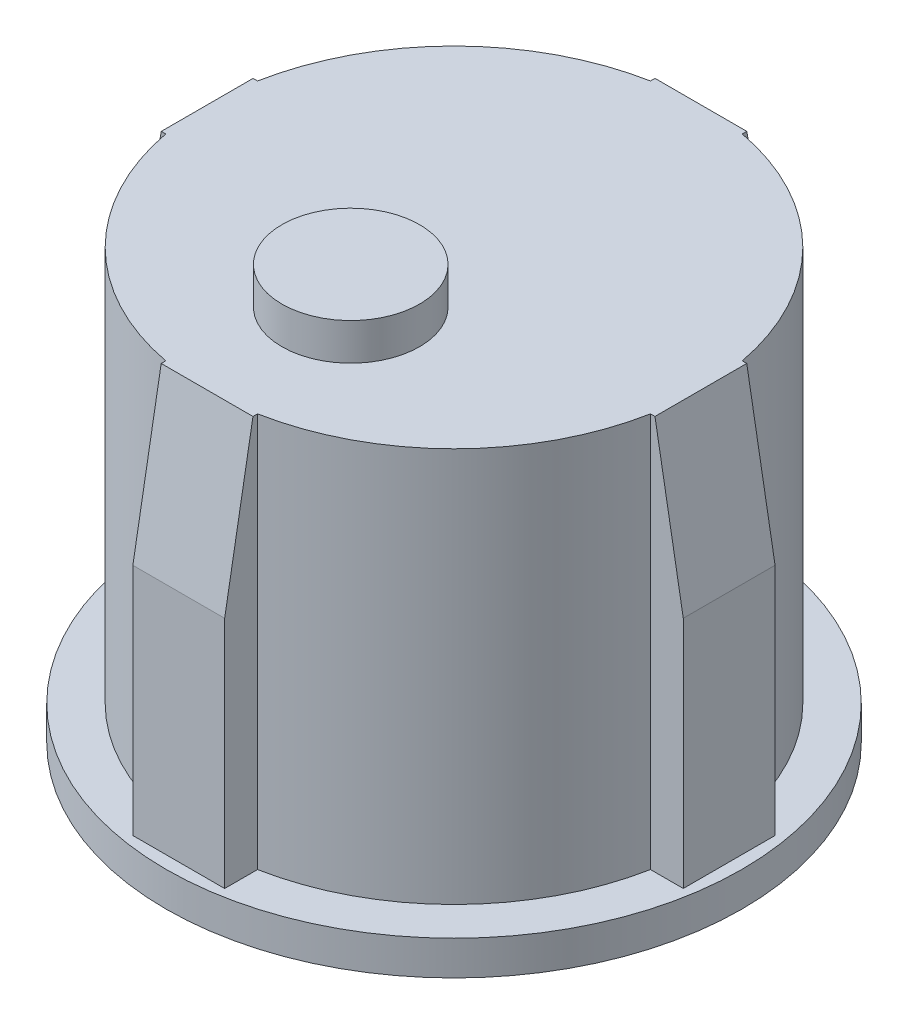
ISO-10303-21;
HEADER;
FILE_DESCRIPTION(('STEP AP214'),'2;1');
FILE_NAME('part.step','',(''),(''),'','','');
FILE_SCHEMA(('AUTOMOTIVE_DESIGN { 1 0 10303 214 1 1 1 1 }'));
ENDSEC;
DATA;
#1=APPLICATION_CONTEXT('core data for automotive mechanical design processes');
#2=APPLICATION_PROTOCOL_DEFINITION('international standard','automotive_design',2000,#1);
#3=PRODUCT_CONTEXT('',#1,'mechanical');
#4=PRODUCT('Part','Part','',(#3));
#5=PRODUCT_RELATED_PRODUCT_CATEGORY('part','',(#4));
#6=PRODUCT_DEFINITION_FORMATION('','',#4);
#7=PRODUCT_DEFINITION_CONTEXT('part definition',#1,'design');
#8=PRODUCT_DEFINITION('design','',#6,#7);
#9=PRODUCT_DEFINITION_SHAPE('','',#8);
#10=(LENGTH_UNIT() NAMED_UNIT(*) SI_UNIT(.MILLI.,.METRE.));
#11=(NAMED_UNIT(*) PLANE_ANGLE_UNIT() SI_UNIT($,.RADIAN.));
#12=(NAMED_UNIT(*) SI_UNIT($,.STERADIAN.) SOLID_ANGLE_UNIT());
#13=UNCERTAINTY_MEASURE_WITH_UNIT(LENGTH_MEASURE(1.E-05),#10,'distance_accuracy_value','');
#14=(GEOMETRIC_REPRESENTATION_CONTEXT(3) GLOBAL_UNCERTAINTY_ASSIGNED_CONTEXT((#13)) GLOBAL_UNIT_ASSIGNED_CONTEXT((#10,
#11,#12)) REPRESENTATION_CONTEXT('',''));
#15=CARTESIAN_POINT('',(0.,0.,0.));
#16=DIRECTION('',(0.,0.,1.));
#17=DIRECTION('',(1.,0.,0.));
#18=AXIS2_PLACEMENT_3D('',#15,#16,#17);
#19=CARTESIAN_POINT('',(0.,1.5,0.));
#20=DIRECTION('',(0.,1.,0.));
#21=DIRECTION('',(0.,0.,1.));
#22=AXIS2_PLACEMENT_3D('',#19,#20,#21);
#23=PLANE('',#22);
#24=CARTESIAN_POINT('',(0.,1.5,0.));
#25=DIRECTION('',(0.,1.,0.));
#26=DIRECTION('',(0.,0.,1.));
#27=AXIS2_PLACEMENT_3D('',#24,#25,#26);
#28=CIRCLE('',#27,12.55);
#29=CARTESIAN_POINT('',(0.,1.5,12.55));
#30=VERTEX_POINT('',#29);
#31=EDGE_CURVE('E341',#30,#30,#28,.T.);
#32=ORIENTED_EDGE('',*,*,#31,.T.);
#33=EDGE_LOOP('',(#32));
#34=FACE_BOUND('',#33,.T.);
#35=CARTESIAN_POINT('',(0.,1.5,0.));
#36=DIRECTION('',(0.,1.,0.));
#37=DIRECTION('',(0.,0.,1.));
#38=AXIS2_PLACEMENT_3D('',#35,#36,#37);
#39=CIRCLE('',#38,10.75);
#40=CARTESIAN_POINT('',(1.99999999999999,1.5,10.5623150871388));
#41=VERTEX_POINT('',#40);
#42=CARTESIAN_POINT('',(10.5623150871388,1.5,1.99999999999999));
#43=VERTEX_POINT('',#42);
#44=EDGE_CURVE('E208',#41,#43,#39,.T.);
#45=ORIENTED_EDGE('',*,*,#44,.F.);
#46=DIRECTION('',(0.,0.,-1.));
#47=VECTOR('',#46,1.);
#48=CARTESIAN_POINT('',(1.99999999999999,1.5,11.994879817949));
#49=LINE('',#48,#47);
#50=CARTESIAN_POINT('',(1.99999999999999,1.5,11.994879817949));
#51=VERTEX_POINT('',#50);
#52=EDGE_CURVE('E291',#51,#41,#49,.T.);
#53=ORIENTED_EDGE('',*,*,#52,.F.);
#54=DIRECTION('',(1.,0.,0.));
#55=VECTOR('',#54,1.);
#56=CARTESIAN_POINT('',(1.99999999999999,1.5,11.994879817949));
#57=LINE('',#56,#55);
#58=CARTESIAN_POINT('',(-2.00000000000001,1.5,11.994879817949));
#59=VERTEX_POINT('',#58);
#60=EDGE_CURVE('E293',#59,#51,#57,.T.);
#61=ORIENTED_EDGE('',*,*,#60,.F.);
#62=DIRECTION('',(0.,0.,1.));
#63=VECTOR('',#62,1.);
#64=CARTESIAN_POINT('',(-2.00000000000001,1.5,11.994879817949));
#65=LINE('',#64,#63);
#66=CARTESIAN_POINT('',(-2.00000000000001,1.5,10.5623150871388));
#67=VERTEX_POINT('',#66);
#68=EDGE_CURVE('E289',#67,#59,#65,.T.);
#69=ORIENTED_EDGE('',*,*,#68,.F.);
#70=CARTESIAN_POINT('',(-10.5623150871388,1.5,2.));
#71=VERTEX_POINT('',#70);
#72=EDGE_CURVE('E187',#71,#67,#39,.T.);
#73=ORIENTED_EDGE('',*,*,#72,.F.);
#74=DIRECTION('',(1.,0.,0.));
#75=VECTOR('',#74,1.);
#76=CARTESIAN_POINT('',(-11.9923150871388,1.5,2.));
#77=LINE('',#76,#75);
#78=CARTESIAN_POINT('',(-11.9923150871388,1.5,2.));
#79=VERTEX_POINT('',#78);
#80=EDGE_CURVE('E272',#79,#71,#77,.T.);
#81=ORIENTED_EDGE('',*,*,#80,.F.);
#82=DIRECTION('',(0.,0.,1.));
#83=VECTOR('',#82,1.);
#84=CARTESIAN_POINT('',(-11.9923150871388,1.5,2.));
#85=LINE('',#84,#83);
#86=CARTESIAN_POINT('',(-11.9923150871388,1.5,-2.));
#87=VERTEX_POINT('',#86);
#88=EDGE_CURVE('E275',#87,#79,#85,.T.);
#89=ORIENTED_EDGE('',*,*,#88,.F.);
#90=DIRECTION('',(-1.,0.,0.));
#91=VECTOR('',#90,1.);
#92=CARTESIAN_POINT('',(-11.9923150871388,1.5,-2.));
#93=LINE('',#92,#91);
#94=CARTESIAN_POINT('',(-10.5623150871388,1.5,-2.));
#95=VERTEX_POINT('',#94);
#96=EDGE_CURVE('E278',#95,#87,#93,.T.);
#97=ORIENTED_EDGE('',*,*,#96,.F.);
#98=CARTESIAN_POINT('',(-2.,1.5,-10.5623150871388));
#99=VERTEX_POINT('',#98);
#100=EDGE_CURVE('E204',#99,#95,#39,.T.);
#101=ORIENTED_EDGE('',*,*,#100,.F.);
#102=DIRECTION('',(0.,0.,1.));
#103=VECTOR('',#102,1.);
#104=CARTESIAN_POINT('',(-2.,1.5,-11.994879817949));
#105=LINE('',#104,#103);
#106=CARTESIAN_POINT('',(-2.,1.5,-11.994879817949));
#107=VERTEX_POINT('',#106);
#108=EDGE_CURVE('E232',#107,#99,#105,.T.);
#109=ORIENTED_EDGE('',*,*,#108,.F.);
#110=DIRECTION('',(-1.,0.,0.));
#111=VECTOR('',#110,1.);
#112=CARTESIAN_POINT('',(2.,1.5,-11.994879817949));
#113=LINE('',#112,#111);
#114=CARTESIAN_POINT('',(2.,1.5,-11.994879817949));
#115=VERTEX_POINT('',#114);
#116=EDGE_CURVE('E235',#115,#107,#113,.T.);
#117=ORIENTED_EDGE('',*,*,#116,.F.);
#118=DIRECTION('',(0.,0.,-1.));
#119=VECTOR('',#118,1.);
#120=CARTESIAN_POINT('',(2.,1.5,-11.994879817949));
#121=LINE('',#120,#119);
#122=CARTESIAN_POINT('',(2.,1.5,-10.5623150871388));
#123=VERTEX_POINT('',#122);
#124=EDGE_CURVE('E238',#123,#115,#121,.T.);
#125=ORIENTED_EDGE('',*,*,#124,.F.);
#126=CARTESIAN_POINT('',(10.5623150871388,1.5,-2.00000000000001));
#127=VERTEX_POINT('',#126);
#128=EDGE_CURVE('E209',#127,#123,#39,.T.);
#129=ORIENTED_EDGE('',*,*,#128,.F.);
#130=DIRECTION('',(-1.,0.,0.));
#131=VECTOR('',#130,1.);
#132=CARTESIAN_POINT('',(11.9923150871388,1.5,-2.00000000000001));
#133=LINE('',#132,#131);
#134=CARTESIAN_POINT('',(11.9923150871388,1.5,-2.00000000000001));
#135=VERTEX_POINT('',#134);
#136=EDGE_CURVE('E256',#135,#127,#133,.T.);
#137=ORIENTED_EDGE('',*,*,#136,.F.);
#138=DIRECTION('',(0.,0.,-1.));
#139=VECTOR('',#138,1.);
#140=CARTESIAN_POINT('',(11.9923150871388,1.5,1.99999999999999));
#141=LINE('',#140,#139);
#142=CARTESIAN_POINT('',(11.9923150871388,1.5,1.99999999999999));
#143=VERTEX_POINT('',#142);
#144=EDGE_CURVE('E258',#143,#135,#141,.T.);
#145=ORIENTED_EDGE('',*,*,#144,.F.);
#146=DIRECTION('',(1.,0.,0.));
#147=VECTOR('',#146,1.);
#148=CARTESIAN_POINT('',(11.9923150871388,1.5,1.99999999999999));
#149=LINE('',#148,#147);
#150=EDGE_CURVE('E252',#43,#143,#149,.T.);
#151=ORIENTED_EDGE('',*,*,#150,.F.);
#152=EDGE_LOOP('',(#45,#53,#61,#69,#73,#81,#89,#97,#101,#109,#117,#125,#129,#137,#145,#151));
#153=FACE_BOUND('',#152,.T.);
#154=ADVANCED_FACE('F32',(#34,#153),#23,.T.);
#155=CARTESIAN_POINT('',(0.,18.7,0.));
#156=DIRECTION('',(0.,-1.,0.));
#157=DIRECTION('',(0.,0.,-1.));
#158=AXIS2_PLACEMENT_3D('',#155,#156,#157);
#159=CYLINDRICAL_SURFACE('',#158,10.75);
#160=DIRECTION('',(0.,-1.,0.));
#161=VECTOR('',#160,1.);
#162=CARTESIAN_POINT('',(1.99999999999999,18.7,10.5623150871388));
#163=LINE('',#162,#161);
#164=CARTESIAN_POINT('',(1.99999999999999,18.7,10.5623150871388));
#165=VERTEX_POINT('',#164);
#166=EDGE_CURVE('E188',#165,#41,#163,.T.);
#167=ORIENTED_EDGE('',*,*,#166,.T.);
#168=ORIENTED_EDGE('',*,*,#44,.T.);
#169=DIRECTION('',(0.,-1.,0.));
#170=VECTOR('',#169,1.);
#171=CARTESIAN_POINT('',(10.5623150871388,18.7,1.99999999999999));
#172=LINE('',#171,#170);
#173=CARTESIAN_POINT('',(10.5623150871388,18.7,1.99999999999999));
#174=VERTEX_POINT('',#173);
#175=EDGE_CURVE('E246',#174,#43,#172,.T.);
#176=ORIENTED_EDGE('',*,*,#175,.F.);
#177=CARTESIAN_POINT('',(0.,18.7,0.));
#178=DIRECTION('',(0.,1.,0.));
#179=DIRECTION('',(0.,0.,1.));
#180=AXIS2_PLACEMENT_3D('',#177,#178,#179);
#181=CIRCLE('',#180,10.75);
#182=EDGE_CURVE('E197',#165,#174,#181,.T.);
#183=ORIENTED_EDGE('',*,*,#182,.F.);
#184=EDGE_LOOP('',(#167,#168,#176,#183));
#185=FACE_BOUND('',#184,.T.);
#186=ADVANCED_FACE('F400',(#185),#159,.T.);
#187=DIRECTION('',(0.,-1.,0.));
#188=VECTOR('',#187,1.);
#189=CARTESIAN_POINT('',(-2.00000000000001,18.7,10.5623150871388));
#190=LINE('',#189,#188);
#191=CARTESIAN_POINT('',(-2.00000000000001,18.7,10.5623150871388));
#192=VERTEX_POINT('',#191);
#193=EDGE_CURVE('E170',#192,#67,#190,.T.);
#194=ORIENTED_EDGE('',*,*,#193,.F.);
#195=CARTESIAN_POINT('',(-10.5623150871388,18.7,2.));
#196=VERTEX_POINT('',#195);
#197=EDGE_CURVE('E185',#196,#192,#181,.T.);
#198=ORIENTED_EDGE('',*,*,#197,.F.);
#199=DIRECTION('',(0.,-1.,0.));
#200=VECTOR('',#199,1.);
#201=CARTESIAN_POINT('',(-10.5623150871388,18.7,2.));
#202=LINE('',#201,#200);
#203=EDGE_CURVE('E268',#196,#71,#202,.T.);
#204=ORIENTED_EDGE('',*,*,#203,.T.);
#205=ORIENTED_EDGE('',*,*,#72,.T.);
#206=EDGE_LOOP('',(#194,#198,#204,#205));
#207=FACE_BOUND('',#206,.T.);
#208=ADVANCED_FACE('F183',(#207),#159,.T.);
#209=DIRECTION('',(0.,-1.,0.));
#210=VECTOR('',#209,1.);
#211=CARTESIAN_POINT('',(-10.5623150871388,18.7,-2.));
#212=LINE('',#211,#210);
#213=CARTESIAN_POINT('',(-10.5623150871388,18.7,-2.));
#214=VERTEX_POINT('',#213);
#215=EDGE_CURVE('E270',#214,#95,#212,.T.);
#216=ORIENTED_EDGE('',*,*,#215,.F.);
#217=CARTESIAN_POINT('',(-2.,18.7,-10.5623150871388));
#218=VERTEX_POINT('',#217);
#219=EDGE_CURVE('E196',#218,#214,#181,.T.);
#220=ORIENTED_EDGE('',*,*,#219,.F.);
#221=DIRECTION('',(0.,-1.,0.));
#222=VECTOR('',#221,1.);
#223=CARTESIAN_POINT('',(-2.,18.7,-10.5623150871388));
#224=LINE('',#223,#222);
#225=EDGE_CURVE('E229',#218,#99,#224,.T.);
#226=ORIENTED_EDGE('',*,*,#225,.T.);
#227=ORIENTED_EDGE('',*,*,#100,.T.);
#228=EDGE_LOOP('',(#216,#220,#226,#227));
#229=FACE_BOUND('',#228,.T.);
#230=ADVANCED_FACE('F398',(#229),#159,.T.);
#231=DIRECTION('',(0.,-1.,0.));
#232=VECTOR('',#231,1.);
#233=CARTESIAN_POINT('',(10.5623150871388,18.7,-2.00000000000001));
#234=LINE('',#233,#232);
#235=CARTESIAN_POINT('',(10.5623150871388,18.7,-2.00000000000001));
#236=VERTEX_POINT('',#235);
#237=EDGE_CURVE('E244',#236,#127,#234,.T.);
#238=ORIENTED_EDGE('',*,*,#237,.T.);
#239=ORIENTED_EDGE('',*,*,#128,.T.);
#240=DIRECTION('',(0.,-1.,0.));
#241=VECTOR('',#240,1.);
#242=CARTESIAN_POINT('',(2.,18.7,-10.5623150871388));
#243=LINE('',#242,#241);
#244=CARTESIAN_POINT('',(2.,18.7,-10.5623150871388));
#245=VERTEX_POINT('',#244);
#246=EDGE_CURVE('E215',#245,#123,#243,.T.);
#247=ORIENTED_EDGE('',*,*,#246,.F.);
#248=EDGE_CURVE('E199',#236,#245,#181,.T.);
#249=ORIENTED_EDGE('',*,*,#248,.F.);
#250=EDGE_LOOP('',(#238,#239,#247,#249));
#251=FACE_BOUND('',#250,.T.);
#252=ADVANCED_FACE('F396',(#251),#159,.T.);
#253=CARTESIAN_POINT('',(0.,1.5,0.));
#254=DIRECTION('',(0.,-1.,0.));
#255=DIRECTION('',(0.,0.,-1.));
#256=AXIS2_PLACEMENT_3D('',#253,#254,#255);
#257=CYLINDRICAL_SURFACE('',#256,12.55);
#258=ORIENTED_EDGE('',*,*,#31,.F.);
#259=EDGE_LOOP('',(#258));
#260=FACE_BOUND('',#259,.T.);
#261=CARTESIAN_POINT('',(0.,0.,0.));
#262=DIRECTION('',(0.,1.,0.));
#263=DIRECTION('',(0.,0.,1.));
#264=AXIS2_PLACEMENT_3D('',#261,#262,#263);
#265=CIRCLE('',#264,12.55);
#266=CARTESIAN_POINT('',(0.,0.,12.55));
#267=VERTEX_POINT('',#266);
#268=EDGE_CURVE('E201',#267,#267,#265,.T.);
#269=ORIENTED_EDGE('',*,*,#268,.T.);
#270=EDGE_LOOP('',(#269));
#271=FACE_BOUND('',#270,.T.);
#272=ADVANCED_FACE('F335',(#260,#271),#257,.T.);
#273=CARTESIAN_POINT('',(0.,0.,0.));
#274=DIRECTION('',(0.,1.,0.));
#275=DIRECTION('',(0.,0.,1.));
#276=AXIS2_PLACEMENT_3D('',#273,#274,#275);
#277=PLANE('',#276);
#278=CARTESIAN_POINT('',(0.,0.,0.));
#279=DIRECTION('',(0.,-1.,0.));
#280=DIRECTION('',(0.,0.,-1.));
#281=AXIS2_PLACEMENT_3D('',#278,#279,#280);
#282=CIRCLE('',#281,7.);
#283=CARTESIAN_POINT('',(0.,0.,-7.));
#284=VERTEX_POINT('',#283);
#285=EDGE_CURVE('E304',#284,#284,#282,.T.);
#286=ORIENTED_EDGE('',*,*,#285,.F.);
#287=EDGE_LOOP('',(#286));
#288=FACE_BOUND('',#287,.T.);
#289=ORIENTED_EDGE('',*,*,#268,.F.);
#290=EDGE_LOOP('',(#289));
#291=FACE_BOUND('',#290,.T.);
#292=ADVANCED_FACE('F332',(#288,#291),#277,.F.);
#293=CARTESIAN_POINT('',(0.,18.7,0.));
#294=DIRECTION('',(0.,1.,0.));
#295=DIRECTION('',(0.,0.,1.));
#296=AXIS2_PLACEMENT_3D('',#293,#294,#295);
#297=PLANE('',#296);
#298=CARTESIAN_POINT('',(0.,18.7,4.5));
#299=DIRECTION('',(0.,1.,0.));
#300=DIRECTION('',(0.,0.,1.));
#301=AXIS2_PLACEMENT_3D('',#298,#299,#300);
#302=CIRCLE('',#301,3.);
#303=CARTESIAN_POINT('',(0.,18.7,7.5));
#304=VERTEX_POINT('',#303);
#305=EDGE_CURVE('E298',#304,#304,#302,.T.);
#306=ORIENTED_EDGE('',*,*,#305,.F.);
#307=EDGE_LOOP('',(#306));
#308=FACE_BOUND('',#307,.T.);
#309=DIRECTION('',(0.,0.,-1.));
#310=VECTOR('',#309,1.);
#311=CARTESIAN_POINT('',(2.,18.7,-11.994879817949));
#312=LINE('',#311,#310);
#313=CARTESIAN_POINT('',(2.,18.7,-10.7605909529898));
#314=VERTEX_POINT('',#313);
#315=EDGE_CURVE('E234',#245,#314,#312,.T.);
#316=ORIENTED_EDGE('',*,*,#315,.T.);
#317=DIRECTION('',(-1.,0.,0.));
#318=VECTOR('',#317,1.);
#319=CARTESIAN_POINT('',(-2.,18.7,-10.7605909529898));
#320=LINE('',#319,#318);
#321=CARTESIAN_POINT('',(-2.,18.7,-10.7605909529898));
#322=VERTEX_POINT('',#321);
#323=EDGE_CURVE('E352',#314,#322,#320,.T.);
#324=ORIENTED_EDGE('',*,*,#323,.T.);
#325=DIRECTION('',(0.,0.,1.));
#326=VECTOR('',#325,1.);
#327=CARTESIAN_POINT('',(-2.,18.7,-11.994879817949));
#328=LINE('',#327,#326);
#329=EDGE_CURVE('E231',#322,#218,#328,.T.);
#330=ORIENTED_EDGE('',*,*,#329,.T.);
#331=ORIENTED_EDGE('',*,*,#219,.T.);
#332=DIRECTION('',(-1.,0.,0.));
#333=VECTOR('',#332,1.);
#334=CARTESIAN_POINT('',(-11.9923150871388,18.7,-2.));
#335=LINE('',#334,#333);
#336=CARTESIAN_POINT('',(-10.7580262221795,18.7,-2.));
#337=VERTEX_POINT('',#336);
#338=EDGE_CURVE('E274',#214,#337,#335,.T.);
#339=ORIENTED_EDGE('',*,*,#338,.T.);
#340=DIRECTION('',(0.,0.,1.));
#341=VECTOR('',#340,1.);
#342=CARTESIAN_POINT('',(-10.7580262221795,18.7,2.));
#343=LINE('',#342,#341);
#344=CARTESIAN_POINT('',(-10.7580262221795,18.7,2.));
#345=VERTEX_POINT('',#344);
#346=EDGE_CURVE('E350',#337,#345,#343,.T.);
#347=ORIENTED_EDGE('',*,*,#346,.T.);
#348=DIRECTION('',(1.,0.,0.));
#349=VECTOR('',#348,1.);
#350=CARTESIAN_POINT('',(-11.9923150871388,18.7,2.));
#351=LINE('',#350,#349);
#352=EDGE_CURVE('E194',#345,#196,#351,.T.);
#353=ORIENTED_EDGE('',*,*,#352,.T.);
#354=ORIENTED_EDGE('',*,*,#197,.T.);
#355=DIRECTION('',(0.,0.,1.));
#356=VECTOR('',#355,1.);
#357=CARTESIAN_POINT('',(-2.00000000000001,18.7,11.994879817949));
#358=LINE('',#357,#356);
#359=CARTESIAN_POINT('',(-2.00000000000001,18.7,10.7605909529898));
#360=VERTEX_POINT('',#359);
#361=EDGE_CURVE('E166',#192,#360,#358,.T.);
#362=ORIENTED_EDGE('',*,*,#361,.T.);
#363=DIRECTION('',(1.,0.,0.));
#364=VECTOR('',#363,1.);
#365=CARTESIAN_POINT('',(1.99999999999999,18.7,10.7605909529898));
#366=LINE('',#365,#364);
#367=CARTESIAN_POINT('',(1.99999999999999,18.7,10.7605909529898));
#368=VERTEX_POINT('',#367);
#369=EDGE_CURVE('E344',#360,#368,#366,.T.);
#370=ORIENTED_EDGE('',*,*,#369,.T.);
#371=DIRECTION('',(0.,0.,-1.));
#372=VECTOR('',#371,1.);
#373=CARTESIAN_POINT('',(1.99999999999999,18.7,11.994879817949));
#374=LINE('',#373,#372);
#375=EDGE_CURVE('E178',#368,#165,#374,.T.);
#376=ORIENTED_EDGE('',*,*,#375,.T.);
#377=ORIENTED_EDGE('',*,*,#182,.T.);
#378=DIRECTION('',(1.,0.,0.));
#379=VECTOR('',#378,1.);
#380=CARTESIAN_POINT('',(11.9923150871388,18.7,1.99999999999999));
#381=LINE('',#380,#379);
#382=CARTESIAN_POINT('',(10.7580262221795,18.7,1.99999999999999));
#383=VERTEX_POINT('',#382);
#384=EDGE_CURVE('E251',#174,#383,#381,.T.);
#385=ORIENTED_EDGE('',*,*,#384,.T.);
#386=DIRECTION('',(0.,0.,-1.));
#387=VECTOR('',#386,1.);
#388=CARTESIAN_POINT('',(10.7580262221795,18.7,-2.00000000000001));
#389=LINE('',#388,#387);
#390=CARTESIAN_POINT('',(10.7580262221795,18.7,-2.00000000000001));
#391=VERTEX_POINT('',#390);
#392=EDGE_CURVE('E347',#383,#391,#389,.T.);
#393=ORIENTED_EDGE('',*,*,#392,.T.);
#394=DIRECTION('',(-1.,0.,0.));
#395=VECTOR('',#394,1.);
#396=CARTESIAN_POINT('',(11.9923150871388,18.7,-2.00000000000001));
#397=LINE('',#396,#395);
#398=EDGE_CURVE('E255',#391,#236,#397,.T.);
#399=ORIENTED_EDGE('',*,*,#398,.T.);
#400=ORIENTED_EDGE('',*,*,#248,.T.);
#401=EDGE_LOOP('',(#316,#324,#330,#331,#339,#347,#353,#354,#362,#370,#376,#377,#385,#393,#399,#400));
#402=FACE_BOUND('',#401,.T.);
#403=ADVANCED_FACE('F191',(#308,#402),#297,.T.);
#404=CARTESIAN_POINT('',(2.,18.7,-11.994879817949));
#405=DIRECTION('',(-1.,0.,0.));
#406=DIRECTION('',(0.,0.,1.));
#407=AXIS2_PLACEMENT_3D('',#404,#405,#406);
#408=PLANE('',#407);
#409=DIRECTION('',(0.,-1.,0.));
#410=VECTOR('',#409,1.);
#411=CARTESIAN_POINT('',(2.,18.7,-11.994879817949));
#412=LINE('',#411,#410);
#413=CARTESIAN_POINT('',(2.,11.6999999999999,-11.994879817949));
#414=VERTEX_POINT('',#413);
#415=EDGE_CURVE('E221',#414,#115,#412,.T.);
#416=ORIENTED_EDGE('',*,*,#415,.F.);
#417=DIRECTION('',(0.,0.984807753012209,0.173648177666927));
#418=VECTOR('',#417,1.);
#419=CARTESIAN_POINT('',(2.,18.7,-10.7605909529898));
#420=LINE('',#419,#418);
#421=EDGE_CURVE('E359',#414,#314,#420,.T.);
#422=ORIENTED_EDGE('',*,*,#421,.T.);
#423=ORIENTED_EDGE('',*,*,#315,.F.);
#424=ORIENTED_EDGE('',*,*,#246,.T.);
#425=ORIENTED_EDGE('',*,*,#124,.T.);
#426=EDGE_LOOP('',(#416,#422,#423,#424,#425));
#427=FACE_BOUND('',#426,.T.);
#428=ADVANCED_FACE('F470',(#427),#408,.F.);
#429=CARTESIAN_POINT('',(2.,18.7,-11.994879817949));
#430=DIRECTION('',(0.,0.,1.));
#431=DIRECTION('',(1.,0.,0.));
#432=AXIS2_PLACEMENT_3D('',#429,#430,#431);
#433=PLANE('',#432);
#434=DIRECTION('',(0.,-1.,0.));
#435=VECTOR('',#434,1.);
#436=CARTESIAN_POINT('',(-2.,18.7,-11.994879817949));
#437=LINE('',#436,#435);
#438=CARTESIAN_POINT('',(-2.,11.6999999999999,-11.994879817949));
#439=VERTEX_POINT('',#438);
#440=EDGE_CURVE('E225',#439,#107,#437,.T.);
#441=ORIENTED_EDGE('',*,*,#440,.F.);
#442=DIRECTION('',(1.,0.,0.));
#443=VECTOR('',#442,1.);
#444=CARTESIAN_POINT('',(2.,11.6999999999999,-11.994879817949));
#445=LINE('',#444,#443);
#446=EDGE_CURVE('E357',#439,#414,#445,.T.);
#447=ORIENTED_EDGE('',*,*,#446,.T.);
#448=ORIENTED_EDGE('',*,*,#415,.T.);
#449=ORIENTED_EDGE('',*,*,#116,.T.);
#450=EDGE_LOOP('',(#441,#447,#448,#449));
#451=FACE_BOUND('',#450,.T.);
#452=ADVANCED_FACE('F466',(#451),#433,.F.);
#453=CARTESIAN_POINT('',(-2.,18.7,-11.994879817949));
#454=DIRECTION('',(1.,0.,0.));
#455=DIRECTION('',(0.,0.,-1.));
#456=AXIS2_PLACEMENT_3D('',#453,#454,#455);
#457=PLANE('',#456);
#458=ORIENTED_EDGE('',*,*,#329,.F.);
#459=DIRECTION('',(0.,-0.984807753012209,-0.173648177666927));
#460=VECTOR('',#459,1.);
#461=CARTESIAN_POINT('',(-2.,18.7,-10.7605909529898));
#462=LINE('',#461,#460);
#463=EDGE_CURVE('E355',#322,#439,#462,.T.);
#464=ORIENTED_EDGE('',*,*,#463,.T.);
#465=ORIENTED_EDGE('',*,*,#440,.T.);
#466=ORIENTED_EDGE('',*,*,#108,.T.);
#467=ORIENTED_EDGE('',*,*,#225,.F.);
#468=EDGE_LOOP('',(#458,#464,#465,#466,#467));
#469=FACE_BOUND('',#468,.T.);
#470=ADVANCED_FACE('F463',(#469),#457,.F.);
#471=CARTESIAN_POINT('',(11.9923150871388,18.7,1.99999999999999));
#472=DIRECTION('',(-1.,0.,0.));
#473=DIRECTION('',(0.,0.,1.));
#474=AXIS2_PLACEMENT_3D('',#471,#472,#473);
#475=PLANE('',#474);
#476=DIRECTION('',(0.,-1.,0.));
#477=VECTOR('',#476,1.);
#478=CARTESIAN_POINT('',(11.9923150871388,18.7,-2.00000000000001));
#479=LINE('',#478,#477);
#480=CARTESIAN_POINT('',(11.9923150871388,11.6999999999999,-2.00000000000001));
#481=VERTEX_POINT('',#480);
#482=EDGE_CURVE('E240',#481,#135,#479,.T.);
#483=ORIENTED_EDGE('',*,*,#482,.F.);
#484=DIRECTION('',(0.,0.,1.));
#485=VECTOR('',#484,1.);
#486=CARTESIAN_POINT('',(11.9923150871388,11.6999999999999,1.99999999999999));
#487=LINE('',#486,#485);
#488=CARTESIAN_POINT('',(11.9923150871388,11.6999999999999,1.99999999999999));
#489=VERTEX_POINT('',#488);
#490=EDGE_CURVE('E369',#481,#489,#487,.T.);
#491=ORIENTED_EDGE('',*,*,#490,.T.);
#492=DIRECTION('',(0.,-1.,0.));
#493=VECTOR('',#492,1.);
#494=CARTESIAN_POINT('',(11.9923150871388,18.7,1.99999999999999));
#495=LINE('',#494,#493);
#496=EDGE_CURVE('E249',#489,#143,#495,.T.);
#497=ORIENTED_EDGE('',*,*,#496,.T.);
#498=ORIENTED_EDGE('',*,*,#144,.T.);
#499=EDGE_LOOP('',(#483,#491,#497,#498));
#500=FACE_BOUND('',#499,.T.);
#501=ADVANCED_FACE('F390',(#500),#475,.F.);
#502=CARTESIAN_POINT('',(11.9923150871388,18.7,-2.00000000000001));
#503=DIRECTION('',(0.,0.,1.));
#504=DIRECTION('',(1.,0.,0.));
#505=AXIS2_PLACEMENT_3D('',#502,#503,#504);
#506=PLANE('',#505);
#507=ORIENTED_EDGE('',*,*,#398,.F.);
#508=DIRECTION('',(0.173648177666927,-0.984807753012209,0.));
#509=VECTOR('',#508,1.);
#510=CARTESIAN_POINT('',(10.7580262221795,18.7,-2.00000000000001));
#511=LINE('',#510,#509);
#512=EDGE_CURVE('E367',#391,#481,#511,.T.);
#513=ORIENTED_EDGE('',*,*,#512,.T.);
#514=ORIENTED_EDGE('',*,*,#482,.T.);
#515=ORIENTED_EDGE('',*,*,#136,.T.);
#516=ORIENTED_EDGE('',*,*,#237,.F.);
#517=EDGE_LOOP('',(#507,#513,#514,#515,#516));
#518=FACE_BOUND('',#517,.T.);
#519=ADVANCED_FACE('F387',(#518),#506,.F.);
#520=CARTESIAN_POINT('',(11.9923150871388,18.7,1.99999999999999));
#521=DIRECTION('',(0.,0.,-1.));
#522=DIRECTION('',(-1.,0.,0.));
#523=AXIS2_PLACEMENT_3D('',#520,#521,#522);
#524=PLANE('',#523);
#525=ORIENTED_EDGE('',*,*,#496,.F.);
#526=DIRECTION('',(-0.173648177666927,0.984807753012209,0.));
#527=VECTOR('',#526,1.);
#528=CARTESIAN_POINT('',(10.7580262221795,18.7,1.99999999999999));
#529=LINE('',#528,#527);
#530=EDGE_CURVE('E371',#489,#383,#529,.T.);
#531=ORIENTED_EDGE('',*,*,#530,.T.);
#532=ORIENTED_EDGE('',*,*,#384,.F.);
#533=ORIENTED_EDGE('',*,*,#175,.T.);
#534=ORIENTED_EDGE('',*,*,#150,.T.);
#535=EDGE_LOOP('',(#525,#531,#532,#533,#534));
#536=FACE_BOUND('',#535,.T.);
#537=ADVANCED_FACE('F377',(#536),#524,.F.);
#538=CARTESIAN_POINT('',(-11.9923150871388,18.7,-2.));
#539=DIRECTION('',(0.,0.,1.));
#540=DIRECTION('',(1.,0.,0.));
#541=AXIS2_PLACEMENT_3D('',#538,#539,#540);
#542=PLANE('',#541);
#543=DIRECTION('',(0.,-1.,0.));
#544=VECTOR('',#543,1.);
#545=CARTESIAN_POINT('',(-11.9923150871388,18.7,-2.));
#546=LINE('',#545,#544);
#547=CARTESIAN_POINT('',(-11.9923150871388,11.6999999999999,-2.));
#548=VERTEX_POINT('',#547);
#549=EDGE_CURVE('E261',#548,#87,#546,.T.);
#550=ORIENTED_EDGE('',*,*,#549,.F.);
#551=DIRECTION('',(0.173648177666927,0.984807753012209,0.));
#552=VECTOR('',#551,1.);
#553=CARTESIAN_POINT('',(-10.7580262221795,18.7,-2.));
#554=LINE('',#553,#552);
#555=EDGE_CURVE('E365',#548,#337,#554,.T.);
#556=ORIENTED_EDGE('',*,*,#555,.T.);
#557=ORIENTED_EDGE('',*,*,#338,.F.);
#558=ORIENTED_EDGE('',*,*,#215,.T.);
#559=ORIENTED_EDGE('',*,*,#96,.T.);
#560=EDGE_LOOP('',(#550,#556,#557,#558,#559));
#561=FACE_BOUND('',#560,.T.);
#562=ADVANCED_FACE('F452',(#561),#542,.F.);
#563=CARTESIAN_POINT('',(-11.9923150871388,18.7,2.));
#564=DIRECTION('',(1.,0.,0.));
#565=DIRECTION('',(0.,0.,-1.));
#566=AXIS2_PLACEMENT_3D('',#563,#564,#565);
#567=PLANE('',#566);
#568=DIRECTION('',(0.,-1.,0.));
#569=VECTOR('',#568,1.);
#570=CARTESIAN_POINT('',(-11.9923150871388,18.7,2.));
#571=LINE('',#570,#569);
#572=CARTESIAN_POINT('',(-11.9923150871388,11.6999999999999,2.));
#573=VERTEX_POINT('',#572);
#574=EDGE_CURVE('E266',#573,#79,#571,.T.);
#575=ORIENTED_EDGE('',*,*,#574,.F.);
#576=DIRECTION('',(0.,0.,-1.));
#577=VECTOR('',#576,1.);
#578=CARTESIAN_POINT('',(-11.9923150871388,11.6999999999999,-2.));
#579=LINE('',#578,#577);
#580=EDGE_CURVE('E363',#573,#548,#579,.T.);
#581=ORIENTED_EDGE('',*,*,#580,.T.);
#582=ORIENTED_EDGE('',*,*,#549,.T.);
#583=ORIENTED_EDGE('',*,*,#88,.T.);
#584=EDGE_LOOP('',(#575,#581,#582,#583));
#585=FACE_BOUND('',#584,.T.);
#586=ADVANCED_FACE('F445',(#585),#567,.F.);
#587=CARTESIAN_POINT('',(-11.9923150871388,18.7,2.));
#588=DIRECTION('',(0.,0.,-1.));
#589=DIRECTION('',(-1.,0.,0.));
#590=AXIS2_PLACEMENT_3D('',#587,#588,#589);
#591=PLANE('',#590);
#592=ORIENTED_EDGE('',*,*,#352,.F.);
#593=DIRECTION('',(-0.173648177666927,-0.984807753012209,0.));
#594=VECTOR('',#593,1.);
#595=CARTESIAN_POINT('',(-10.7580262221795,18.7,2.));
#596=LINE('',#595,#594);
#597=EDGE_CURVE('E361',#345,#573,#596,.T.);
#598=ORIENTED_EDGE('',*,*,#597,.T.);
#599=ORIENTED_EDGE('',*,*,#574,.T.);
#600=ORIENTED_EDGE('',*,*,#80,.T.);
#601=ORIENTED_EDGE('',*,*,#203,.F.);
#602=EDGE_LOOP('',(#592,#598,#599,#600,#601));
#603=FACE_BOUND('',#602,.T.);
#604=ADVANCED_FACE('F438',(#603),#591,.F.);
#605=CARTESIAN_POINT('',(1.99999999999999,18.7,11.994879817949));
#606=DIRECTION('',(0.,0.,-1.));
#607=DIRECTION('',(-1.,0.,0.));
#608=AXIS2_PLACEMENT_3D('',#605,#606,#607);
#609=PLANE('',#608);
#610=DIRECTION('',(0.,-1.,0.));
#611=VECTOR('',#610,1.);
#612=CARTESIAN_POINT('',(1.99999999999999,18.7,11.994879817949));
#613=LINE('',#612,#611);
#614=CARTESIAN_POINT('',(1.99999999999999,11.6999999999999,11.994879817949));
#615=VERTEX_POINT('',#614);
#616=EDGE_CURVE('E281',#615,#51,#613,.T.);
#617=ORIENTED_EDGE('',*,*,#616,.F.);
#618=DIRECTION('',(-1.,0.,0.));
#619=VECTOR('',#618,1.);
#620=CARTESIAN_POINT('',(-2.00000000000001,11.6999999999999,11.994879817949));
#621=LINE('',#620,#619);
#622=CARTESIAN_POINT('',(-2.00000000000001,11.6999999999999,11.994879817949));
#623=VERTEX_POINT('',#622);
#624=EDGE_CURVE('E40',#615,#623,#621,.T.);
#625=ORIENTED_EDGE('',*,*,#624,.T.);
#626=DIRECTION('',(0.,-1.,0.));
#627=VECTOR('',#626,1.);
#628=CARTESIAN_POINT('',(-2.00000000000001,18.7,11.994879817949));
#629=LINE('',#628,#627);
#630=EDGE_CURVE('E177',#623,#59,#629,.T.);
#631=ORIENTED_EDGE('',*,*,#630,.T.);
#632=ORIENTED_EDGE('',*,*,#60,.T.);
#633=EDGE_LOOP('',(#617,#625,#631,#632));
#634=FACE_BOUND('',#633,.T.);
#635=ADVANCED_FACE('F436',(#634),#609,.F.);
#636=CARTESIAN_POINT('',(1.99999999999999,18.7,11.994879817949));
#637=DIRECTION('',(-1.,0.,0.));
#638=DIRECTION('',(0.,0.,1.));
#639=AXIS2_PLACEMENT_3D('',#636,#637,#638);
#640=PLANE('',#639);
#641=ORIENTED_EDGE('',*,*,#375,.F.);
#642=DIRECTION('',(0.,-0.984807753012209,0.173648177666927));
#643=VECTOR('',#642,1.);
#644=CARTESIAN_POINT('',(1.99999999999999,18.7,10.7605909529898));
#645=LINE('',#644,#643);
#646=EDGE_CURVE('E54',#368,#615,#645,.T.);
#647=ORIENTED_EDGE('',*,*,#646,.T.);
#648=ORIENTED_EDGE('',*,*,#616,.T.);
#649=ORIENTED_EDGE('',*,*,#52,.T.);
#650=ORIENTED_EDGE('',*,*,#166,.F.);
#651=EDGE_LOOP('',(#641,#647,#648,#649,#650));
#652=FACE_BOUND('',#651,.T.);
#653=ADVANCED_FACE('F433',(#652),#640,.F.);
#654=CARTESIAN_POINT('',(-2.00000000000001,18.7,11.994879817949));
#655=DIRECTION('',(1.,0.,0.));
#656=DIRECTION('',(0.,0.,-1.));
#657=AXIS2_PLACEMENT_3D('',#654,#655,#656);
#658=PLANE('',#657);
#659=ORIENTED_EDGE('',*,*,#630,.F.);
#660=DIRECTION('',(0.,0.984807753012209,-0.173648177666927));
#661=VECTOR('',#660,1.);
#662=CARTESIAN_POINT('',(-2.00000000000001,18.7,10.7605909529898));
#663=LINE('',#662,#661);
#664=EDGE_CURVE('E11',#623,#360,#663,.T.);
#665=ORIENTED_EDGE('',*,*,#664,.T.);
#666=ORIENTED_EDGE('',*,*,#361,.F.);
#667=ORIENTED_EDGE('',*,*,#193,.T.);
#668=ORIENTED_EDGE('',*,*,#68,.T.);
#669=EDGE_LOOP('',(#659,#665,#666,#667,#668));
#670=FACE_BOUND('',#669,.T.);
#671=ADVANCED_FACE('F168',(#670),#658,.F.);
#672=CARTESIAN_POINT('',(0.,20.31,4.5));
#673=DIRECTION('',(0.,-1.,0.));
#674=DIRECTION('',(0.,0.,-1.));
#675=AXIS2_PLACEMENT_3D('',#672,#673,#674);
#676=CYLINDRICAL_SURFACE('',#675,3.);
#677=CARTESIAN_POINT('',(0.,20.31,4.5));
#678=DIRECTION('',(0.,1.,0.));
#679=DIRECTION('',(0.,0.,1.));
#680=AXIS2_PLACEMENT_3D('',#677,#678,#679);
#681=CIRCLE('',#680,3.);
#682=CARTESIAN_POINT('',(0.,20.31,7.5));
#683=VERTEX_POINT('',#682);
#684=EDGE_CURVE('E295',#683,#683,#681,.T.);
#685=ORIENTED_EDGE('',*,*,#684,.F.);
#686=EDGE_LOOP('',(#685));
#687=FACE_BOUND('',#686,.T.);
#688=ORIENTED_EDGE('',*,*,#305,.T.);
#689=EDGE_LOOP('',(#688));
#690=FACE_BOUND('',#689,.T.);
#691=ADVANCED_FACE('F480',(#687,#690),#676,.T.);
#692=CARTESIAN_POINT('',(0.,20.31,4.5));
#693=DIRECTION('',(0.,1.,0.));
#694=DIRECTION('',(0.,0.,1.));
#695=AXIS2_PLACEMENT_3D('',#692,#693,#694);
#696=PLANE('',#695);
#697=ORIENTED_EDGE('',*,*,#684,.T.);
#698=EDGE_LOOP('',(#697));
#699=FACE_BOUND('',#698,.T.);
#700=ADVANCED_FACE('F328',(#699),#696,.T.);
#701=CARTESIAN_POINT('',(0.,1.,0.));
#702=DIRECTION('',(0.,-1.,0.));
#703=DIRECTION('',(0.,0.,-1.));
#704=AXIS2_PLACEMENT_3D('',#701,#702,#703);
#705=CYLINDRICAL_SURFACE('',#704,7.);
#706=CARTESIAN_POINT('',(0.,1.,0.));
#707=DIRECTION('',(0.,-1.,0.));
#708=DIRECTION('',(0.,0.,-1.));
#709=AXIS2_PLACEMENT_3D('',#706,#707,#708);
#710=CIRCLE('',#709,7.);
#711=CARTESIAN_POINT('',(0.,1.,-7.));
#712=VERTEX_POINT('',#711);
#713=EDGE_CURVE('E301',#712,#712,#710,.T.);
#714=ORIENTED_EDGE('',*,*,#713,.F.);
#715=EDGE_LOOP('',(#714));
#716=FACE_BOUND('',#715,.T.);
#717=ORIENTED_EDGE('',*,*,#285,.T.);
#718=EDGE_LOOP('',(#717));
#719=FACE_BOUND('',#718,.T.);
#720=ADVANCED_FACE('F322',(#716,#719),#705,.F.);
#721=CARTESIAN_POINT('',(0.,1.,0.));
#722=DIRECTION('',(0.,-1.,0.));
#723=DIRECTION('',(0.,0.,-1.));
#724=AXIS2_PLACEMENT_3D('',#721,#722,#723);
#725=PLANE('',#724);
#726=CARTESIAN_POINT('',(0.,1.,0.));
#727=DIRECTION('',(0.,-1.,0.));
#728=DIRECTION('',(0.,0.,-1.));
#729=AXIS2_PLACEMENT_3D('',#726,#727,#728);
#730=CIRCLE('',#729,6.);
#731=CARTESIAN_POINT('',(0.,1.,-6.));
#732=VERTEX_POINT('',#731);
#733=EDGE_CURVE('E307',#732,#732,#730,.T.);
#734=ORIENTED_EDGE('',*,*,#733,.F.);
#735=EDGE_LOOP('',(#734));
#736=FACE_BOUND('',#735,.T.);
#737=ORIENTED_EDGE('',*,*,#713,.T.);
#738=EDGE_LOOP('',(#737));
#739=FACE_BOUND('',#738,.T.);
#740=ADVANCED_FACE('F319',(#736,#739),#725,.T.);
#741=CARTESIAN_POINT('',(0.,1.,0.));
#742=DIRECTION('',(0.,-1.,0.));
#743=DIRECTION('',(0.,0.,-1.));
#744=AXIS2_PLACEMENT_3D('',#741,#742,#743);
#745=CYLINDRICAL_SURFACE('',#744,6.);
#746=ORIENTED_EDGE('',*,*,#733,.T.);
#747=EDGE_LOOP('',(#746));
#748=FACE_BOUND('',#747,.T.);
#749=CARTESIAN_POINT('',(0.,0.,0.));
#750=DIRECTION('',(0.,-1.,0.));
#751=DIRECTION('',(0.,0.,-1.));
#752=AXIS2_PLACEMENT_3D('',#749,#750,#751);
#753=CIRCLE('',#752,6.);
#754=CARTESIAN_POINT('',(0.,0.,-6.));
#755=VERTEX_POINT('',#754);
#756=EDGE_CURVE('E310',#755,#755,#753,.T.);
#757=ORIENTED_EDGE('',*,*,#756,.F.);
#758=EDGE_LOOP('',(#757));
#759=FACE_BOUND('',#758,.T.);
#760=ADVANCED_FACE('F316',(#748,#759),#745,.T.);
#761=ORIENTED_EDGE('',*,*,#756,.T.);
#762=EDGE_LOOP('',(#761));
#763=FACE_BOUND('',#762,.T.);
#764=ADVANCED_FACE('F337',(#763),#277,.F.);
#765=CARTESIAN_POINT('',(0.,18.7,-10.7605909529898));
#766=DIRECTION('',(0.,0.173648177666927,-0.984807753012208));
#767=DIRECTION('',(1.,0.,0.));
#768=AXIS2_PLACEMENT_3D('',#765,#766,#767);
#769=PLANE('',#768);
#770=ORIENTED_EDGE('',*,*,#421,.F.);
#771=ORIENTED_EDGE('',*,*,#446,.F.);
#772=ORIENTED_EDGE('',*,*,#463,.F.);
#773=ORIENTED_EDGE('',*,*,#323,.F.);
#774=EDGE_LOOP('',(#770,#771,#772,#773));
#775=FACE_BOUND('',#774,.T.);
#776=ADVANCED_FACE('F418',(#775),#769,.T.);
#777=CARTESIAN_POINT('',(-10.7580262221795,18.7,0.));
#778=DIRECTION('',(-0.984807753012208,0.173648177666927,0.));
#779=DIRECTION('',(0.,0.,-1.));
#780=AXIS2_PLACEMENT_3D('',#777,#778,#779);
#781=PLANE('',#780);
#782=ORIENTED_EDGE('',*,*,#555,.F.);
#783=ORIENTED_EDGE('',*,*,#580,.F.);
#784=ORIENTED_EDGE('',*,*,#597,.F.);
#785=ORIENTED_EDGE('',*,*,#346,.F.);
#786=EDGE_LOOP('',(#782,#783,#784,#785));
#787=FACE_BOUND('',#786,.T.);
#788=ADVANCED_FACE('F421',(#787),#781,.T.);
#789=CARTESIAN_POINT('',(10.7580262221795,18.7,0.));
#790=DIRECTION('',(0.984807753012208,0.173648177666927,0.));
#791=DIRECTION('',(0.,0.,1.));
#792=AXIS2_PLACEMENT_3D('',#789,#790,#791);
#793=PLANE('',#792);
#794=ORIENTED_EDGE('',*,*,#530,.F.);
#795=ORIENTED_EDGE('',*,*,#490,.F.);
#796=ORIENTED_EDGE('',*,*,#512,.F.);
#797=ORIENTED_EDGE('',*,*,#392,.F.);
#798=EDGE_LOOP('',(#794,#795,#796,#797));
#799=FACE_BOUND('',#798,.T.);
#800=ADVANCED_FACE('F384',(#799),#793,.T.);
#801=CARTESIAN_POINT('',(0.,18.7,10.7605909529898));
#802=DIRECTION('',(0.,0.173648177666927,0.984807753012208));
#803=DIRECTION('',(-1.,0.,0.));
#804=AXIS2_PLACEMENT_3D('',#801,#802,#803);
#805=PLANE('',#804);
#806=ORIENTED_EDGE('',*,*,#664,.F.);
#807=ORIENTED_EDGE('',*,*,#624,.F.);
#808=ORIENTED_EDGE('',*,*,#646,.F.);
#809=ORIENTED_EDGE('',*,*,#369,.F.);
#810=EDGE_LOOP('',(#806,#807,#808,#809));
#811=FACE_BOUND('',#810,.T.);
#812=ADVANCED_FACE('F34',(#811),#805,.T.);
#813=CLOSED_SHELL('',(#154,#186,#208,#230,#252,#272,#292,#403,#428,#452,#470,#501,#519,#537,
#562,#586,#604,#635,#653,#671,#691,#700,#720,#740,#760,#764,#776,#788,#800,#812));
#814=MANIFOLD_SOLID_BREP('B2',#813);
#815=ADVANCED_BREP_SHAPE_REPRESENTATION('',(#18,#814),#14);
#816=SHAPE_DEFINITION_REPRESENTATION(#9,#815);
ENDSEC;
END-ISO-10303-21;
